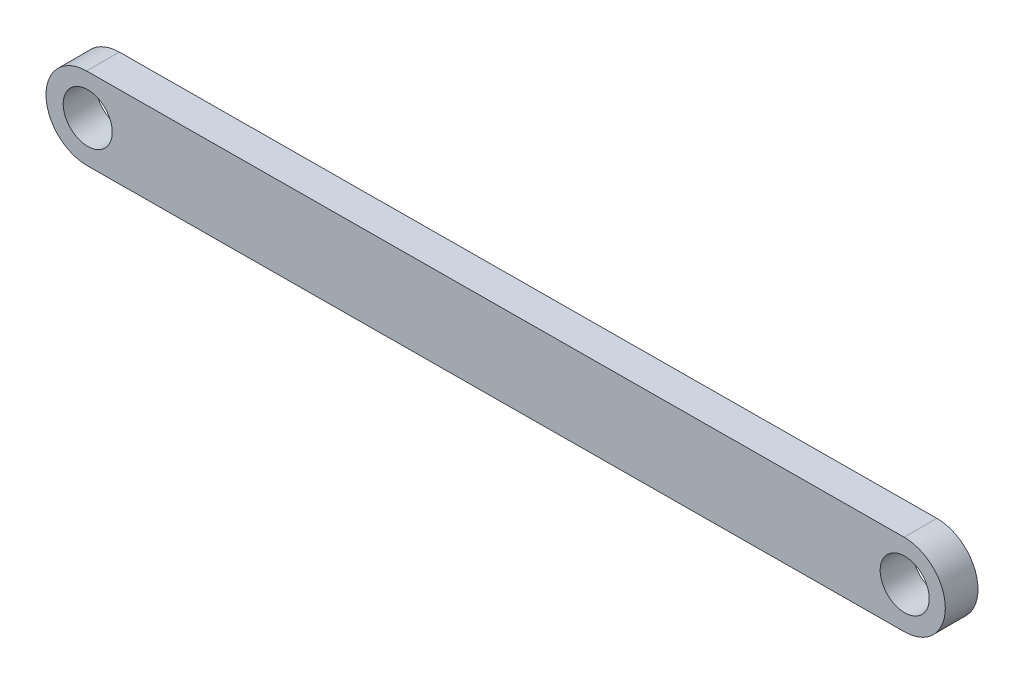
ISO-10303-21;
HEADER;
FILE_DESCRIPTION(('STEP AP214'),'2;1');
FILE_NAME('part.step','',(''),(''),'','','');
FILE_SCHEMA(('AUTOMOTIVE_DESIGN { 1 0 10303 214 1 1 1 1 }'));
ENDSEC;
DATA;
#1=APPLICATION_CONTEXT('core data for automotive mechanical design processes');
#2=APPLICATION_PROTOCOL_DEFINITION('international standard','automotive_design',2000,#1);
#3=PRODUCT_CONTEXT('',#1,'mechanical');
#4=PRODUCT('Part','Part','',(#3));
#5=PRODUCT_RELATED_PRODUCT_CATEGORY('part','',(#4));
#6=PRODUCT_DEFINITION_FORMATION('','',#4);
#7=PRODUCT_DEFINITION_CONTEXT('part definition',#1,'design');
#8=PRODUCT_DEFINITION('design','',#6,#7);
#9=PRODUCT_DEFINITION_SHAPE('','',#8);
#10=(LENGTH_UNIT() NAMED_UNIT(*) SI_UNIT(.MILLI.,.METRE.));
#11=(NAMED_UNIT(*) PLANE_ANGLE_UNIT() SI_UNIT($,.RADIAN.));
#12=(NAMED_UNIT(*) SI_UNIT($,.STERADIAN.) SOLID_ANGLE_UNIT());
#13=UNCERTAINTY_MEASURE_WITH_UNIT(LENGTH_MEASURE(1.E-05),#10,'distance_accuracy_value','');
#14=(GEOMETRIC_REPRESENTATION_CONTEXT(3) GLOBAL_UNCERTAINTY_ASSIGNED_CONTEXT((#13)) GLOBAL_UNIT_ASSIGNED_CONTEXT((#10,
#11,#12)) REPRESENTATION_CONTEXT('',''));
#15=CARTESIAN_POINT('',(0.,0.,0.));
#16=DIRECTION('',(0.,0.,1.));
#17=DIRECTION('',(1.,0.,0.));
#18=AXIS2_PLACEMENT_3D('',#15,#16,#17);
#19=CARTESIAN_POINT('',(0.0254958332884211,-0.0638424735976699,2.));
#20=DIRECTION('',(0.,0.,1.));
#21=DIRECTION('',(1.,0.,0.));
#22=AXIS2_PLACEMENT_3D('',#19,#20,#21);
#23=PLANE('',#22);
#24=CARTESIAN_POINT('',(0.0769735521426659,-0.0231369198777347,2.));
#25=DIRECTION('',(0.,0.,1.));
#26=DIRECTION('',(1.,0.,0.));
#27=AXIS2_PLACEMENT_3D('',#24,#25,#26);
#28=CIRCLE('',#27,1.5);
#29=CARTESIAN_POINT('',(1.57697355214267,-0.0231369198777347,2.));
#30=VERTEX_POINT('',#29);
#31=EDGE_CURVE('E101',#30,#30,#28,.T.);
#32=ORIENTED_EDGE('',*,*,#31,.F.);
#33=EDGE_LOOP('',(#32));
#34=FACE_BOUND('',#33,.T.);
#35=CARTESIAN_POINT('',(0.0254958332884211,-0.0638424735976699,2.));
#36=DIRECTION('',(0.,0.,1.));
#37=DIRECTION('',(1.,0.,0.));
#38=AXIS2_PLACEMENT_3D('',#35,#36,#37);
#39=CIRCLE('',#38,2.5);
#40=CARTESIAN_POINT('',(0.0102831332012609,2.43611124072507,2.));
#41=VERTEX_POINT('',#40);
#42=CARTESIAN_POINT('',(0.0407085333755747,-2.56379618792041,2.));
#43=VERTEX_POINT('',#42);
#44=EDGE_CURVE('E86',#41,#43,#39,.T.);
#45=ORIENTED_EDGE('',*,*,#44,.T.);
#46=DIRECTION('',(0.999981485729095,0.00608508003486274,0.));
#47=VECTOR('',#46,1.);
#48=CARTESIAN_POINT('',(0.0407085333755747,-2.56379618792041,2.));
#49=LINE('',#48,#47);
#50=CARTESIAN_POINT('',(50.0407085333756,-2.25953655303196,2.));
#51=VERTEX_POINT('',#50);
#52=EDGE_CURVE('E81',#43,#51,#49,.T.);
#53=ORIENTED_EDGE('',*,*,#52,.T.);
#54=CARTESIAN_POINT('',(50.0254958332884,0.240417161290773,2.));
#55=DIRECTION('',(0.,0.,1.));
#56=DIRECTION('',(1.,0.,0.));
#57=AXIS2_PLACEMENT_3D('',#54,#55,#56);
#58=CIRCLE('',#57,2.5);
#59=CARTESIAN_POINT('',(50.0102831332013,2.74037087561351,2.));
#60=VERTEX_POINT('',#59);
#61=EDGE_CURVE('E84',#51,#60,#58,.T.);
#62=ORIENTED_EDGE('',*,*,#61,.T.);
#63=DIRECTION('',(-0.999981485729095,-0.00608508003486275,0.));
#64=VECTOR('',#63,1.);
#65=CARTESIAN_POINT('',(0.0102831332012609,2.43611124072507,2.));
#66=LINE('',#65,#64);
#67=EDGE_CURVE('E51',#60,#41,#66,.T.);
#68=ORIENTED_EDGE('',*,*,#67,.T.);
#69=EDGE_LOOP('',(#45,#53,#62,#68));
#70=FACE_BOUND('',#69,.T.);
#71=CARTESIAN_POINT('',(50.0423453575969,0.254710298110966,2.));
#72=DIRECTION('',(0.,0.,1.));
#73=DIRECTION('',(1.,0.,0.));
#74=AXIS2_PLACEMENT_3D('',#71,#72,#73);
#75=CIRCLE('',#74,1.5);
#76=CARTESIAN_POINT('',(51.5423453575969,0.254710298110966,2.));
#77=VERTEX_POINT('',#76);
#78=EDGE_CURVE('E116',#77,#77,#75,.T.);
#79=ORIENTED_EDGE('',*,*,#78,.F.);
#80=EDGE_LOOP('',(#79));
#81=FACE_BOUND('',#80,.T.);
#82=ADVANCED_FACE('F34',(#34,#70,#81),#23,.T.);
#83=CARTESIAN_POINT('',(0.0254958332884211,-0.0638424735976699,0.));
#84=DIRECTION('',(0.,0.,1.));
#85=DIRECTION('',(1.,0.,0.));
#86=AXIS2_PLACEMENT_3D('',#83,#84,#85);
#87=PLANE('',#86);
#88=CARTESIAN_POINT('',(0.0254958332884211,-0.0638424735976699,0.));
#89=DIRECTION('',(0.,0.,1.));
#90=DIRECTION('',(1.,0.,0.));
#91=AXIS2_PLACEMENT_3D('',#88,#89,#90);
#92=CIRCLE('',#91,2.5);
#93=CARTESIAN_POINT('',(0.0102831332012609,2.43611124072507,0.));
#94=VERTEX_POINT('',#93);
#95=CARTESIAN_POINT('',(0.0407085333755747,-2.56379618792041,0.));
#96=VERTEX_POINT('',#95);
#97=EDGE_CURVE('E98',#94,#96,#92,.T.);
#98=ORIENTED_EDGE('',*,*,#97,.F.);
#99=DIRECTION('',(-0.999981485729095,-0.00608508003486275,0.));
#100=VECTOR('',#99,1.);
#101=CARTESIAN_POINT('',(0.0102831332012609,2.43611124072507,0.));
#102=LINE('',#101,#100);
#103=CARTESIAN_POINT('',(50.0102831332013,2.74037087561351,0.));
#104=VERTEX_POINT('',#103);
#105=EDGE_CURVE('E74',#104,#94,#102,.T.);
#106=ORIENTED_EDGE('',*,*,#105,.F.);
#107=CARTESIAN_POINT('',(50.0254958332884,0.240417161290773,0.));
#108=DIRECTION('',(0.,0.,1.));
#109=DIRECTION('',(1.,0.,0.));
#110=AXIS2_PLACEMENT_3D('',#107,#108,#109);
#111=CIRCLE('',#110,2.5);
#112=CARTESIAN_POINT('',(50.0407085333756,-2.25953655303196,0.));
#113=VERTEX_POINT('',#112);
#114=EDGE_CURVE('E68',#113,#104,#111,.T.);
#115=ORIENTED_EDGE('',*,*,#114,.F.);
#116=DIRECTION('',(0.999981485729095,0.00608508003486274,0.));
#117=VECTOR('',#116,1.);
#118=CARTESIAN_POINT('',(0.0407085333755747,-2.56379618792041,0.));
#119=LINE('',#118,#117);
#120=EDGE_CURVE('E90',#96,#113,#119,.T.);
#121=ORIENTED_EDGE('',*,*,#120,.F.);
#122=EDGE_LOOP('',(#98,#106,#115,#121));
#123=FACE_BOUND('',#122,.T.);
#124=CARTESIAN_POINT('',(0.0769735521426659,-0.0231369198777347,0.));
#125=DIRECTION('',(0.,0.,1.));
#126=DIRECTION('',(1.,0.,0.));
#127=AXIS2_PLACEMENT_3D('',#124,#125,#126);
#128=CIRCLE('',#127,1.5);
#129=CARTESIAN_POINT('',(1.57697355214267,-0.0231369198777347,0.));
#130=VERTEX_POINT('',#129);
#131=EDGE_CURVE('E113',#130,#130,#128,.T.);
#132=ORIENTED_EDGE('',*,*,#131,.T.);
#133=EDGE_LOOP('',(#132));
#134=FACE_BOUND('',#133,.T.);
#135=CARTESIAN_POINT('',(50.0423453575969,0.254710298110966,0.));
#136=DIRECTION('',(0.,0.,1.));
#137=DIRECTION('',(1.,0.,0.));
#138=AXIS2_PLACEMENT_3D('',#135,#136,#137);
#139=CIRCLE('',#138,1.5);
#140=CARTESIAN_POINT('',(51.5423453575969,0.254710298110966,0.));
#141=VERTEX_POINT('',#140);
#142=EDGE_CURVE('E119',#141,#141,#139,.T.);
#143=ORIENTED_EDGE('',*,*,#142,.T.);
#144=EDGE_LOOP('',(#143));
#145=FACE_BOUND('',#144,.T.);
#146=ADVANCED_FACE('F109',(#123,#134,#145),#87,.F.);
#147=CARTESIAN_POINT('',(0.0254958332884211,-0.0638424735976699,2.));
#148=DIRECTION('',(0.,0.,-1.));
#149=DIRECTION('',(-1.,0.,0.));
#150=AXIS2_PLACEMENT_3D('',#147,#148,#149);
#151=CYLINDRICAL_SURFACE('',#150,2.5);
#152=ORIENTED_EDGE('',*,*,#97,.T.);
#153=DIRECTION('',(0.,0.,-1.));
#154=VECTOR('',#153,1.);
#155=CARTESIAN_POINT('',(0.0407085333755747,-2.56379618792041,2.));
#156=LINE('',#155,#154);
#157=EDGE_CURVE('E11',#43,#96,#156,.T.);
#158=ORIENTED_EDGE('',*,*,#157,.F.);
#159=ORIENTED_EDGE('',*,*,#44,.F.);
#160=DIRECTION('',(0.,0.,-1.));
#161=VECTOR('',#160,1.);
#162=CARTESIAN_POINT('',(0.0102831332012609,2.43611124072507,2.));
#163=LINE('',#162,#161);
#164=EDGE_CURVE('E94',#41,#94,#163,.T.);
#165=ORIENTED_EDGE('',*,*,#164,.T.);
#166=EDGE_LOOP('',(#152,#158,#159,#165));
#167=FACE_BOUND('',#166,.T.);
#168=ADVANCED_FACE('F36',(#167),#151,.T.);
#169=CARTESIAN_POINT('',(0.0407085333755747,-2.56379618792041,2.));
#170=DIRECTION('',(-0.00608508003486274,0.999981485729095,0.));
#171=DIRECTION('',(-0.999981485729096,-0.00608508003486274,0.));
#172=AXIS2_PLACEMENT_3D('',#169,#170,#171);
#173=PLANE('',#172);
#174=ORIENTED_EDGE('',*,*,#120,.T.);
#175=DIRECTION('',(0.,0.,-1.));
#176=VECTOR('',#175,1.);
#177=CARTESIAN_POINT('',(50.0407085333756,-2.25953655303196,2.));
#178=LINE('',#177,#176);
#179=EDGE_CURVE('E43',#51,#113,#178,.T.);
#180=ORIENTED_EDGE('',*,*,#179,.F.);
#181=ORIENTED_EDGE('',*,*,#52,.F.);
#182=ORIENTED_EDGE('',*,*,#157,.T.);
#183=EDGE_LOOP('',(#174,#180,#181,#182));
#184=FACE_BOUND('',#183,.T.);
#185=ADVANCED_FACE('F89',(#184),#173,.F.);
#186=CARTESIAN_POINT('',(50.0254958332884,0.240417161290773,2.));
#187=DIRECTION('',(0.,0.,-1.));
#188=DIRECTION('',(-1.,0.,0.));
#189=AXIS2_PLACEMENT_3D('',#186,#187,#188);
#190=CYLINDRICAL_SURFACE('',#189,2.5);
#191=ORIENTED_EDGE('',*,*,#114,.T.);
#192=DIRECTION('',(0.,0.,-1.));
#193=VECTOR('',#192,1.);
#194=CARTESIAN_POINT('',(50.0102831332013,2.74037087561351,2.));
#195=LINE('',#194,#193);
#196=EDGE_CURVE('E91',#60,#104,#195,.T.);
#197=ORIENTED_EDGE('',*,*,#196,.F.);
#198=ORIENTED_EDGE('',*,*,#61,.F.);
#199=ORIENTED_EDGE('',*,*,#179,.T.);
#200=EDGE_LOOP('',(#191,#197,#198,#199));
#201=FACE_BOUND('',#200,.T.);
#202=ADVANCED_FACE('F92',(#201),#190,.T.);
#203=CARTESIAN_POINT('',(0.0102831332012609,2.43611124072507,2.));
#204=DIRECTION('',(0.00608508003486275,-0.999981485729095,0.));
#205=DIRECTION('',(0.999981485729096,0.00608508003486275,0.));
#206=AXIS2_PLACEMENT_3D('',#203,#204,#205);
#207=PLANE('',#206);
#208=ORIENTED_EDGE('',*,*,#105,.T.);
#209=ORIENTED_EDGE('',*,*,#164,.F.);
#210=ORIENTED_EDGE('',*,*,#67,.F.);
#211=ORIENTED_EDGE('',*,*,#196,.T.);
#212=EDGE_LOOP('',(#208,#209,#210,#211));
#213=FACE_BOUND('',#212,.T.);
#214=ADVANCED_FACE('F106',(#213),#207,.F.);
#215=CARTESIAN_POINT('',(0.0769735521426659,-0.0231369198777347,2.));
#216=DIRECTION('',(0.,0.,-1.));
#217=DIRECTION('',(-1.,0.,0.));
#218=AXIS2_PLACEMENT_3D('',#215,#216,#217);
#219=CYLINDRICAL_SURFACE('',#218,1.5);
#220=ORIENTED_EDGE('',*,*,#31,.T.);
#221=EDGE_LOOP('',(#220));
#222=FACE_BOUND('',#221,.T.);
#223=ORIENTED_EDGE('',*,*,#131,.F.);
#224=EDGE_LOOP('',(#223));
#225=FACE_BOUND('',#224,.T.);
#226=ADVANCED_FACE('F136',(#222,#225),#219,.F.);
#227=CARTESIAN_POINT('',(50.0423453575969,0.254710298110966,2.));
#228=DIRECTION('',(0.,0.,-1.));
#229=DIRECTION('',(-1.,0.,0.));
#230=AXIS2_PLACEMENT_3D('',#227,#228,#229);
#231=CYLINDRICAL_SURFACE('',#230,1.5);
#232=ORIENTED_EDGE('',*,*,#78,.T.);
#233=EDGE_LOOP('',(#232));
#234=FACE_BOUND('',#233,.T.);
#235=ORIENTED_EDGE('',*,*,#142,.F.);
#236=EDGE_LOOP('',(#235));
#237=FACE_BOUND('',#236,.T.);
#238=ADVANCED_FACE('F125',(#234,#237),#231,.F.);
#239=CLOSED_SHELL('',(#82,#146,#168,#185,#202,#214,#226,#238));
#240=MANIFOLD_SOLID_BREP('B2',#239);
#241=ADVANCED_BREP_SHAPE_REPRESENTATION('',(#18,#240),#14);
#242=SHAPE_DEFINITION_REPRESENTATION(#9,#241);
ENDSEC;
END-ISO-10303-21;
